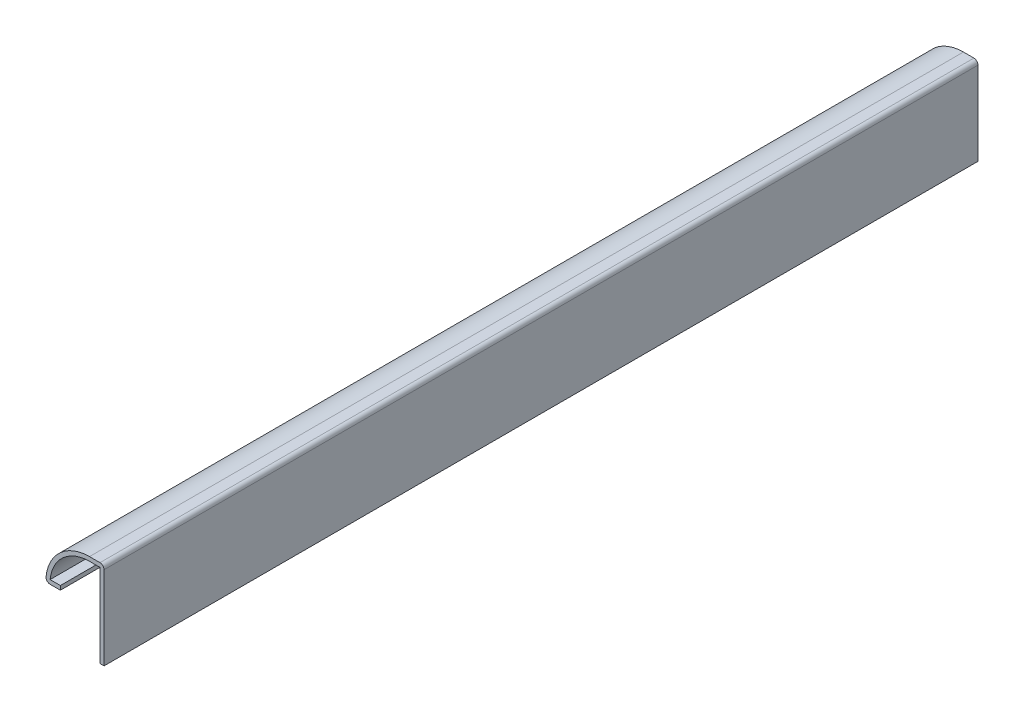
ISO-10303-21;
HEADER;
FILE_DESCRIPTION(('STEP AP214'),'2;1');
FILE_NAME('part.step','',(''),(''),'','','');
FILE_SCHEMA(('AUTOMOTIVE_DESIGN { 1 0 10303 214 1 1 1 1 }'));
ENDSEC;
DATA;
#1=APPLICATION_CONTEXT('core data for automotive mechanical design processes');
#2=APPLICATION_PROTOCOL_DEFINITION('international standard','automotive_design',2000,#1);
#3=PRODUCT_CONTEXT('',#1,'mechanical');
#4=PRODUCT('Part','Part','',(#3));
#5=PRODUCT_RELATED_PRODUCT_CATEGORY('part','',(#4));
#6=PRODUCT_DEFINITION_FORMATION('','',#4);
#7=PRODUCT_DEFINITION_CONTEXT('part definition',#1,'design');
#8=PRODUCT_DEFINITION('design','',#6,#7);
#9=PRODUCT_DEFINITION_SHAPE('','',#8);
#10=(LENGTH_UNIT() NAMED_UNIT(*) SI_UNIT(.MILLI.,.METRE.));
#11=(NAMED_UNIT(*) PLANE_ANGLE_UNIT() SI_UNIT($,.RADIAN.));
#12=(NAMED_UNIT(*) SI_UNIT($,.STERADIAN.) SOLID_ANGLE_UNIT());
#13=UNCERTAINTY_MEASURE_WITH_UNIT(LENGTH_MEASURE(1.E-05),#10,'distance_accuracy_value','');
#14=(GEOMETRIC_REPRESENTATION_CONTEXT(3) GLOBAL_UNCERTAINTY_ASSIGNED_CONTEXT((#13)) GLOBAL_UNIT_ASSIGNED_CONTEXT((#10,
#11,#12)) REPRESENTATION_CONTEXT('',''));
#15=CARTESIAN_POINT('',(0.,0.,0.));
#16=DIRECTION('',(0.,0.,1.));
#17=DIRECTION('',(1.,0.,0.));
#18=AXIS2_PLACEMENT_3D('',#15,#16,#17);
#19=CARTESIAN_POINT('',(-12.7,9.525,-190.5));
#20=DIRECTION('',(0.,-1.,0.));
#21=DIRECTION('',(1.,0.,0.));
#22=AXIS2_PLACEMENT_3D('',#19,#20,#21);
#23=PLANE('',#22);
#24=DIRECTION('',(1.,0.,0.));
#25=VECTOR('',#24,1.);
#26=CARTESIAN_POINT('',(-12.7,9.525,0.));
#27=LINE('',#26,#25);
#28=CARTESIAN_POINT('',(-11.7651207791276,9.525,0.));
#29=VERTEX_POINT('',#28);
#30=CARTESIAN_POINT('',(-9.525,9.525,0.));
#31=VERTEX_POINT('',#30);
#32=EDGE_CURVE('E207',#29,#31,#27,.T.);
#33=ORIENTED_EDGE('',*,*,#32,.F.);
#34=DIRECTION('',(0.,0.,1.));
#35=VECTOR('',#34,1.);
#36=CARTESIAN_POINT('',(-11.7651207791276,9.525,-190.5));
#37=LINE('',#36,#35);
#38=CARTESIAN_POINT('',(-11.7651207791276,9.525,-190.5));
#39=VERTEX_POINT('',#38);
#40=EDGE_CURVE('E11',#29,#39,#37,.F.);
#41=ORIENTED_EDGE('',*,*,#40,.T.);
#42=DIRECTION('',(1.,0.,0.));
#43=VECTOR('',#42,1.);
#44=CARTESIAN_POINT('',(-12.7,9.525,-190.5));
#45=LINE('',#44,#43);
#46=CARTESIAN_POINT('',(-9.525,9.525,-190.5));
#47=VERTEX_POINT('',#46);
#48=EDGE_CURVE('E122',#39,#47,#45,.T.);
#49=ORIENTED_EDGE('',*,*,#48,.T.);
#50=DIRECTION('',(0.,0.,1.));
#51=VECTOR('',#50,1.);
#52=CARTESIAN_POINT('',(-9.525,9.525,-190.5));
#53=LINE('',#52,#51);
#54=EDGE_CURVE('E125',#47,#31,#53,.T.);
#55=ORIENTED_EDGE('',*,*,#54,.T.);
#56=EDGE_LOOP('',(#33,#41,#49,#55));
#57=FACE_BOUND('',#56,.T.);
#58=ADVANCED_FACE('F35',(#57),#23,.T.);
#59=CARTESIAN_POINT('',(-3.175,9.525,-190.5));
#60=DIRECTION('',(0.,0.,1.));
#61=DIRECTION('',(1.,0.,0.));
#62=AXIS2_PLACEMENT_3D('',#59,#60,#61);
#63=CYLINDRICAL_SURFACE('',#62,9.525);
#64=CARTESIAN_POINT('',(-3.175,9.525,-190.5));
#65=DIRECTION('',(0.,0.,1.));
#66=DIRECTION('',(1.,0.,0.));
#67=AXIS2_PLACEMENT_3D('',#64,#65,#66);
#68=CIRCLE('',#67,9.525);
#69=CARTESIAN_POINT('',(-3.175,19.05,-190.5));
#70=VERTEX_POINT('',#69);
#71=CARTESIAN_POINT('',(-12.6493979181555,10.5055147058823,-190.5));
#72=VERTEX_POINT('',#71);
#73=EDGE_CURVE('E143',#70,#72,#68,.T.);
#74=ORIENTED_EDGE('',*,*,#73,.T.);
#75=DIRECTION('',(0.,0.,1.));
#76=VECTOR('',#75,1.);
#77=CARTESIAN_POINT('',(-12.6493979181555,10.5055147058823,-190.5));
#78=LINE('',#77,#76);
#79=CARTESIAN_POINT('',(-12.6493979181555,10.5055147058823,0.));
#80=VERTEX_POINT('',#79);
#81=EDGE_CURVE('E43',#72,#80,#78,.T.);
#82=ORIENTED_EDGE('',*,*,#81,.T.);
#83=CARTESIAN_POINT('',(-3.175,9.525,0.));
#84=DIRECTION('',(0.,0.,1.));
#85=DIRECTION('',(1.,0.,0.));
#86=AXIS2_PLACEMENT_3D('',#83,#84,#85);
#87=CIRCLE('',#86,9.525);
#88=CARTESIAN_POINT('',(-3.175,19.05,0.));
#89=VERTEX_POINT('',#88);
#90=EDGE_CURVE('E128',#89,#80,#87,.T.);
#91=ORIENTED_EDGE('',*,*,#90,.F.);
#92=DIRECTION('',(0.,0.,1.));
#93=VECTOR('',#92,1.);
#94=CARTESIAN_POINT('',(-3.175,19.05,-190.5));
#95=LINE('',#94,#93);
#96=EDGE_CURVE('E155',#70,#89,#95,.T.);
#97=ORIENTED_EDGE('',*,*,#96,.F.);
#98=EDGE_LOOP('',(#74,#82,#91,#97));
#99=FACE_BOUND('',#98,.T.);
#100=ADVANCED_FACE('F168',(#99),#63,.T.);
#101=CARTESIAN_POINT('',(0.,19.05,-190.5));
#102=DIRECTION('',(0.,1.,0.));
#103=DIRECTION('',(-1.,0.,0.));
#104=AXIS2_PLACEMENT_3D('',#101,#102,#103);
#105=PLANE('',#104);
#106=DIRECTION('',(-1.,0.,0.));
#107=VECTOR('',#106,1.);
#108=CARTESIAN_POINT('',(0.,19.05,0.));
#109=LINE('',#108,#107);
#110=CARTESIAN_POINT('',(-0.889000000000001,19.05,0.));
#111=VERTEX_POINT('',#110);
#112=EDGE_CURVE('E175',#111,#89,#109,.T.);
#113=ORIENTED_EDGE('',*,*,#112,.F.);
#114=DIRECTION('',(0.,0.,1.));
#115=VECTOR('',#114,1.);
#116=CARTESIAN_POINT('',(-0.889000000000001,19.05,-190.5));
#117=LINE('',#116,#115);
#118=CARTESIAN_POINT('',(-0.889000000000001,19.05,-190.5));
#119=VERTEX_POINT('',#118);
#120=EDGE_CURVE('E159',#111,#119,#117,.F.);
#121=ORIENTED_EDGE('',*,*,#120,.T.);
#122=DIRECTION('',(-1.,0.,0.));
#123=VECTOR('',#122,1.);
#124=CARTESIAN_POINT('',(0.,19.05,-190.5));
#125=LINE('',#124,#123);
#126=EDGE_CURVE('E147',#119,#70,#125,.T.);
#127=ORIENTED_EDGE('',*,*,#126,.T.);
#128=ORIENTED_EDGE('',*,*,#96,.T.);
#129=EDGE_LOOP('',(#113,#121,#127,#128));
#130=FACE_BOUND('',#129,.T.);
#131=ADVANCED_FACE('F230',(#130),#105,.T.);
#132=CARTESIAN_POINT('',(0.,0.,-190.5));
#133=DIRECTION('',(1.,0.,0.));
#134=DIRECTION('',(0.,0.,-1.));
#135=AXIS2_PLACEMENT_3D('',#132,#133,#134);
#136=PLANE('',#135);
#137=DIRECTION('',(0.,1.,0.));
#138=VECTOR('',#137,1.);
#139=CARTESIAN_POINT('',(0.,0.,-190.5));
#140=LINE('',#139,#138);
#141=CARTESIAN_POINT('',(0.,0.,-190.5));
#142=VERTEX_POINT('',#141);
#143=CARTESIAN_POINT('',(0.,18.161,-190.5));
#144=VERTEX_POINT('',#143);
#145=EDGE_CURVE('E224',#142,#144,#140,.T.);
#146=ORIENTED_EDGE('',*,*,#145,.T.);
#147=DIRECTION('',(0.,0.,1.));
#148=VECTOR('',#147,1.);
#149=CARTESIAN_POINT('',(0.,18.161,-190.5));
#150=LINE('',#149,#148);
#151=CARTESIAN_POINT('',(0.,18.161,0.));
#152=VERTEX_POINT('',#151);
#153=EDGE_CURVE('E151',#144,#152,#150,.T.);
#154=ORIENTED_EDGE('',*,*,#153,.T.);
#155=DIRECTION('',(0.,1.,0.));
#156=VECTOR('',#155,1.);
#157=CARTESIAN_POINT('',(0.,0.,0.));
#158=LINE('',#157,#156);
#159=CARTESIAN_POINT('',(0.,0.,0.));
#160=VERTEX_POINT('',#159);
#161=EDGE_CURVE('E178',#160,#152,#158,.T.);
#162=ORIENTED_EDGE('',*,*,#161,.F.);
#163=DIRECTION('',(0.,0.,1.));
#164=VECTOR('',#163,1.);
#165=CARTESIAN_POINT('',(0.,0.,-190.5));
#166=LINE('',#165,#164);
#167=EDGE_CURVE('E183',#142,#160,#166,.T.);
#168=ORIENTED_EDGE('',*,*,#167,.F.);
#169=EDGE_LOOP('',(#146,#154,#162,#168));
#170=FACE_BOUND('',#169,.T.);
#171=ADVANCED_FACE('F220',(#170),#136,.T.);
#172=CARTESIAN_POINT('',(0.,0.,-190.5));
#173=DIRECTION('',(0.,1.,0.));
#174=DIRECTION('',(0.,0.,1.));
#175=AXIS2_PLACEMENT_3D('',#172,#173,#174);
#176=PLANE('',#175);
#177=DIRECTION('',(-1.,0.,0.));
#178=VECTOR('',#177,1.);
#179=CARTESIAN_POINT('',(0.,0.,0.));
#180=LINE('',#179,#178);
#181=CARTESIAN_POINT('',(-0.889,0.,0.));
#182=VERTEX_POINT('',#181);
#183=EDGE_CURVE('E214',#160,#182,#180,.T.);
#184=ORIENTED_EDGE('',*,*,#183,.T.);
#185=DIRECTION('',(0.,0.,1.));
#186=VECTOR('',#185,1.);
#187=CARTESIAN_POINT('',(-0.889,0.,-190.5));
#188=LINE('',#187,#186);
#189=CARTESIAN_POINT('',(-0.889,0.,-190.5));
#190=VERTEX_POINT('',#189);
#191=EDGE_CURVE('E185',#190,#182,#188,.T.);
#192=ORIENTED_EDGE('',*,*,#191,.F.);
#193=DIRECTION('',(-1.,0.,0.));
#194=VECTOR('',#193,1.);
#195=CARTESIAN_POINT('',(0.,0.,-190.5));
#196=LINE('',#195,#194);
#197=EDGE_CURVE('E232',#142,#190,#196,.T.);
#198=ORIENTED_EDGE('',*,*,#197,.F.);
#199=ORIENTED_EDGE('',*,*,#167,.T.);
#200=EDGE_LOOP('',(#184,#192,#198,#199));
#201=FACE_BOUND('',#200,.T.);
#202=ADVANCED_FACE('F260',(#201),#176,.F.);
#203=CARTESIAN_POINT('',(-0.889,0.,-190.5));
#204=DIRECTION('',(1.,0.,0.));
#205=DIRECTION('',(0.,0.,-1.));
#206=AXIS2_PLACEMENT_3D('',#203,#204,#205);
#207=PLANE('',#206);
#208=DIRECTION('',(0.,1.,0.));
#209=VECTOR('',#208,1.);
#210=CARTESIAN_POINT('',(-0.889,0.,0.));
#211=LINE('',#210,#209);
#212=CARTESIAN_POINT('',(-0.889,18.161,0.));
#213=VERTEX_POINT('',#212);
#214=EDGE_CURVE('E212',#182,#213,#211,.T.);
#215=ORIENTED_EDGE('',*,*,#214,.T.);
#216=DIRECTION('',(0.,0.,1.));
#217=VECTOR('',#216,1.);
#218=CARTESIAN_POINT('',(-0.889,18.161,-190.5));
#219=LINE('',#218,#217);
#220=CARTESIAN_POINT('',(-0.889,18.161,-190.5));
#221=VERTEX_POINT('',#220);
#222=EDGE_CURVE('E188',#221,#213,#219,.T.);
#223=ORIENTED_EDGE('',*,*,#222,.F.);
#224=DIRECTION('',(0.,1.,0.));
#225=VECTOR('',#224,1.);
#226=CARTESIAN_POINT('',(-0.889,0.,-190.5));
#227=LINE('',#226,#225);
#228=EDGE_CURVE('E357',#190,#221,#227,.T.);
#229=ORIENTED_EDGE('',*,*,#228,.F.);
#230=ORIENTED_EDGE('',*,*,#191,.T.);
#231=EDGE_LOOP('',(#215,#223,#229,#230));
#232=FACE_BOUND('',#231,.T.);
#233=ADVANCED_FACE('F256',(#232),#207,.F.);
#234=CARTESIAN_POINT('',(0.,18.161,-190.5));
#235=DIRECTION('',(0.,1.,0.));
#236=DIRECTION('',(-1.,0.,0.));
#237=AXIS2_PLACEMENT_3D('',#234,#235,#236);
#238=PLANE('',#237);
#239=DIRECTION('',(-1.,0.,0.));
#240=VECTOR('',#239,1.);
#241=CARTESIAN_POINT('',(0.,18.161,0.));
#242=LINE('',#241,#240);
#243=CARTESIAN_POINT('',(-3.175,18.161,0.));
#244=VERTEX_POINT('',#243);
#245=EDGE_CURVE('E205',#213,#244,#242,.T.);
#246=ORIENTED_EDGE('',*,*,#245,.T.);
#247=DIRECTION('',(0.,0.,1.));
#248=VECTOR('',#247,1.);
#249=CARTESIAN_POINT('',(-3.175,18.161,-190.5));
#250=LINE('',#249,#248);
#251=CARTESIAN_POINT('',(-3.175,18.161,-190.5));
#252=VERTEX_POINT('',#251);
#253=EDGE_CURVE('E191',#252,#244,#250,.T.);
#254=ORIENTED_EDGE('',*,*,#253,.F.);
#255=DIRECTION('',(-1.,0.,0.));
#256=VECTOR('',#255,1.);
#257=CARTESIAN_POINT('',(0.,18.161,-190.5));
#258=LINE('',#257,#256);
#259=EDGE_CURVE('E361',#221,#252,#258,.T.);
#260=ORIENTED_EDGE('',*,*,#259,.F.);
#261=ORIENTED_EDGE('',*,*,#222,.T.);
#262=EDGE_LOOP('',(#246,#254,#260,#261));
#263=FACE_BOUND('',#262,.T.);
#264=ADVANCED_FACE('F253',(#263),#238,.F.);
#265=CARTESIAN_POINT('',(-3.175,9.525,-190.5));
#266=DIRECTION('',(0.,0.,1.));
#267=DIRECTION('',(1.,0.,0.));
#268=AXIS2_PLACEMENT_3D('',#265,#266,#267);
#269=CYLINDRICAL_SURFACE('',#268,8.636);
#270=CARTESIAN_POINT('',(-3.175,9.525,0.));
#271=DIRECTION('',(0.,0.,1.));
#272=DIRECTION('',(1.,0.,0.));
#273=AXIS2_PLACEMENT_3D('',#270,#271,#272);
#274=CIRCLE('',#273,8.636);
#275=CARTESIAN_POINT('',(-11.7651207791276,10.414,0.));
#276=VERTEX_POINT('',#275);
#277=EDGE_CURVE('E203',#244,#276,#274,.T.);
#278=ORIENTED_EDGE('',*,*,#277,.T.);
#279=DIRECTION('',(0.,0.,1.));
#280=VECTOR('',#279,1.);
#281=CARTESIAN_POINT('',(-11.7651207791276,10.414,-190.5));
#282=LINE('',#281,#280);
#283=CARTESIAN_POINT('',(-11.7651207791276,10.414,-190.5));
#284=VERTEX_POINT('',#283);
#285=EDGE_CURVE('E145',#284,#276,#282,.T.);
#286=ORIENTED_EDGE('',*,*,#285,.F.);
#287=CARTESIAN_POINT('',(-3.175,9.525,-190.5));
#288=DIRECTION('',(0.,0.,1.));
#289=DIRECTION('',(1.,0.,0.));
#290=AXIS2_PLACEMENT_3D('',#287,#288,#289);
#291=CIRCLE('',#290,8.636);
#292=EDGE_CURVE('E360',#252,#284,#291,.T.);
#293=ORIENTED_EDGE('',*,*,#292,.F.);
#294=ORIENTED_EDGE('',*,*,#253,.T.);
#295=EDGE_LOOP('',(#278,#286,#293,#294));
#296=FACE_BOUND('',#295,.T.);
#297=ADVANCED_FACE('F250',(#296),#269,.F.);
#298=CARTESIAN_POINT('',(-12.7,10.414,-190.5));
#299=DIRECTION('',(0.,-1.,0.));
#300=DIRECTION('',(1.,0.,0.));
#301=AXIS2_PLACEMENT_3D('',#298,#299,#300);
#302=PLANE('',#301);
#303=DIRECTION('',(1.,0.,0.));
#304=VECTOR('',#303,1.);
#305=CARTESIAN_POINT('',(-12.7,10.414,0.));
#306=LINE('',#305,#304);
#307=CARTESIAN_POINT('',(-9.525,10.414,0.));
#308=VERTEX_POINT('',#307);
#309=EDGE_CURVE('E198',#276,#308,#306,.T.);
#310=ORIENTED_EDGE('',*,*,#309,.T.);
#311=DIRECTION('',(0.,0.,1.));
#312=VECTOR('',#311,1.);
#313=CARTESIAN_POINT('',(-9.525,10.414,-190.5));
#314=LINE('',#313,#312);
#315=CARTESIAN_POINT('',(-9.525,10.414,-190.5));
#316=VERTEX_POINT('',#315);
#317=EDGE_CURVE('E142',#316,#308,#314,.T.);
#318=ORIENTED_EDGE('',*,*,#317,.F.);
#319=DIRECTION('',(1.,0.,0.));
#320=VECTOR('',#319,1.);
#321=CARTESIAN_POINT('',(-12.7,10.414,-190.5));
#322=LINE('',#321,#320);
#323=EDGE_CURVE('E134',#284,#316,#322,.T.);
#324=ORIENTED_EDGE('',*,*,#323,.F.);
#325=ORIENTED_EDGE('',*,*,#285,.T.);
#326=EDGE_LOOP('',(#310,#318,#324,#325));
#327=FACE_BOUND('',#326,.T.);
#328=ADVANCED_FACE('F197',(#327),#302,.F.);
#329=CARTESIAN_POINT('',(-9.525,10.414,-190.5));
#330=DIRECTION('',(-1.,0.,0.));
#331=DIRECTION('',(0.,0.,1.));
#332=AXIS2_PLACEMENT_3D('',#329,#330,#331);
#333=PLANE('',#332);
#334=DIRECTION('',(0.,-1.,0.));
#335=VECTOR('',#334,1.);
#336=CARTESIAN_POINT('',(-9.525,10.414,0.));
#337=LINE('',#336,#335);
#338=EDGE_CURVE('E141',#308,#31,#337,.T.);
#339=ORIENTED_EDGE('',*,*,#338,.T.);
#340=ORIENTED_EDGE('',*,*,#54,.F.);
#341=DIRECTION('',(0.,-1.,0.));
#342=VECTOR('',#341,1.);
#343=CARTESIAN_POINT('',(-9.525,10.414,-190.5));
#344=LINE('',#343,#342);
#345=EDGE_CURVE('E127',#316,#47,#344,.T.);
#346=ORIENTED_EDGE('',*,*,#345,.F.);
#347=ORIENTED_EDGE('',*,*,#317,.T.);
#348=EDGE_LOOP('',(#339,#340,#346,#347));
#349=FACE_BOUND('',#348,.T.);
#350=ADVANCED_FACE('F139',(#349),#333,.F.);
#351=CARTESIAN_POINT('',(-3.175,9.525,-190.5));
#352=DIRECTION('',(0.,0.,1.));
#353=DIRECTION('',(1.,0.,0.));
#354=AXIS2_PLACEMENT_3D('',#351,#352,#353);
#355=PLANE('',#354);
#356=ORIENTED_EDGE('',*,*,#126,.F.);
#357=CARTESIAN_POINT('',(-0.889,18.161,-190.5));
#358=DIRECTION('',(0.,0.,1.));
#359=DIRECTION('',(1.,0.,0.));
#360=AXIS2_PLACEMENT_3D('',#357,#358,#359);
#361=CIRCLE('',#360,0.889);
#362=EDGE_CURVE('E162',#119,#144,#361,.F.);
#363=ORIENTED_EDGE('',*,*,#362,.T.);
#364=ORIENTED_EDGE('',*,*,#145,.F.);
#365=ORIENTED_EDGE('',*,*,#197,.T.);
#366=ORIENTED_EDGE('',*,*,#228,.T.);
#367=ORIENTED_EDGE('',*,*,#259,.T.);
#368=ORIENTED_EDGE('',*,*,#292,.T.);
#369=ORIENTED_EDGE('',*,*,#323,.T.);
#370=ORIENTED_EDGE('',*,*,#345,.T.);
#371=ORIENTED_EDGE('',*,*,#48,.F.);
#372=CARTESIAN_POINT('',(-11.7651207791276,10.414,-190.5));
#373=DIRECTION('',(0.,0.,1.));
#374=DIRECTION('',(1.,0.,0.));
#375=AXIS2_PLACEMENT_3D('',#372,#373,#374);
#376=CIRCLE('',#375,0.889);
#377=EDGE_CURVE('E50',#39,#72,#376,.F.);
#378=ORIENTED_EDGE('',*,*,#377,.T.);
#379=ORIENTED_EDGE('',*,*,#73,.F.);
#380=EDGE_LOOP('',(#356,#363,#364,#365,#366,#367,#368,#369,#370,#371,#378,#379));
#381=FACE_BOUND('',#380,.T.);
#382=ADVANCED_FACE('F132',(#381),#355,.F.);
#383=CARTESIAN_POINT('',(-3.175,9.525,0.));
#384=DIRECTION('',(0.,0.,1.));
#385=DIRECTION('',(1.,0.,0.));
#386=AXIS2_PLACEMENT_3D('',#383,#384,#385);
#387=PLANE('',#386);
#388=ORIENTED_EDGE('',*,*,#161,.T.);
#389=CARTESIAN_POINT('',(-0.889,18.161,0.));
#390=DIRECTION('',(0.,0.,1.));
#391=DIRECTION('',(1.,0.,0.));
#392=AXIS2_PLACEMENT_3D('',#389,#390,#391);
#393=CIRCLE('',#392,0.889);
#394=EDGE_CURVE('E157',#152,#111,#393,.T.);
#395=ORIENTED_EDGE('',*,*,#394,.T.);
#396=ORIENTED_EDGE('',*,*,#112,.T.);
#397=ORIENTED_EDGE('',*,*,#90,.T.);
#398=CARTESIAN_POINT('',(-11.7651207791276,10.414,0.));
#399=DIRECTION('',(0.,0.,1.));
#400=DIRECTION('',(1.,0.,0.));
#401=AXIS2_PLACEMENT_3D('',#398,#399,#400);
#402=CIRCLE('',#401,0.889);
#403=EDGE_CURVE('E154',#80,#29,#402,.T.);
#404=ORIENTED_EDGE('',*,*,#403,.T.);
#405=ORIENTED_EDGE('',*,*,#32,.T.);
#406=ORIENTED_EDGE('',*,*,#338,.F.);
#407=ORIENTED_EDGE('',*,*,#309,.F.);
#408=ORIENTED_EDGE('',*,*,#277,.F.);
#409=ORIENTED_EDGE('',*,*,#245,.F.);
#410=ORIENTED_EDGE('',*,*,#214,.F.);
#411=ORIENTED_EDGE('',*,*,#183,.F.);
#412=EDGE_LOOP('',(#388,#395,#396,#397,#404,#405,#406,#407,#408,#409,#410,#411));
#413=FACE_BOUND('',#412,.T.);
#414=ADVANCED_FACE('F173',(#413),#387,.T.);
#415=CARTESIAN_POINT('',(-0.889,18.161,-190.5));
#416=DIRECTION('',(0.,0.,1.));
#417=DIRECTION('',(1.,0.,0.));
#418=AXIS2_PLACEMENT_3D('',#415,#416,#417);
#419=CYLINDRICAL_SURFACE('',#418,0.889);
#420=ORIENTED_EDGE('',*,*,#362,.F.);
#421=ORIENTED_EDGE('',*,*,#120,.F.);
#422=ORIENTED_EDGE('',*,*,#394,.F.);
#423=ORIENTED_EDGE('',*,*,#153,.F.);
#424=EDGE_LOOP('',(#420,#421,#422,#423));
#425=FACE_BOUND('',#424,.T.);
#426=ADVANCED_FACE('F227',(#425),#419,.T.);
#427=CARTESIAN_POINT('',(-11.7651207791276,10.414,-190.5));
#428=DIRECTION('',(0.,0.,1.));
#429=DIRECTION('',(1.,0.,0.));
#430=AXIS2_PLACEMENT_3D('',#427,#428,#429);
#431=CYLINDRICAL_SURFACE('',#430,0.889);
#432=ORIENTED_EDGE('',*,*,#377,.F.);
#433=ORIENTED_EDGE('',*,*,#40,.F.);
#434=ORIENTED_EDGE('',*,*,#403,.F.);
#435=ORIENTED_EDGE('',*,*,#81,.F.);
#436=EDGE_LOOP('',(#432,#433,#434,#435));
#437=FACE_BOUND('',#436,.T.);
#438=ADVANCED_FACE('F37',(#437),#431,.T.);
#439=CLOSED_SHELL('',(#58,#100,#131,#171,#202,#233,#264,#297,#328,#350,#382,#414,#426,#438));
#440=MANIFOLD_SOLID_BREP('B2',#439);
#441=ADVANCED_BREP_SHAPE_REPRESENTATION('',(#18,#440),#14);
#442=SHAPE_DEFINITION_REPRESENTATION(#9,#441);
ENDSEC;
END-ISO-10303-21;
